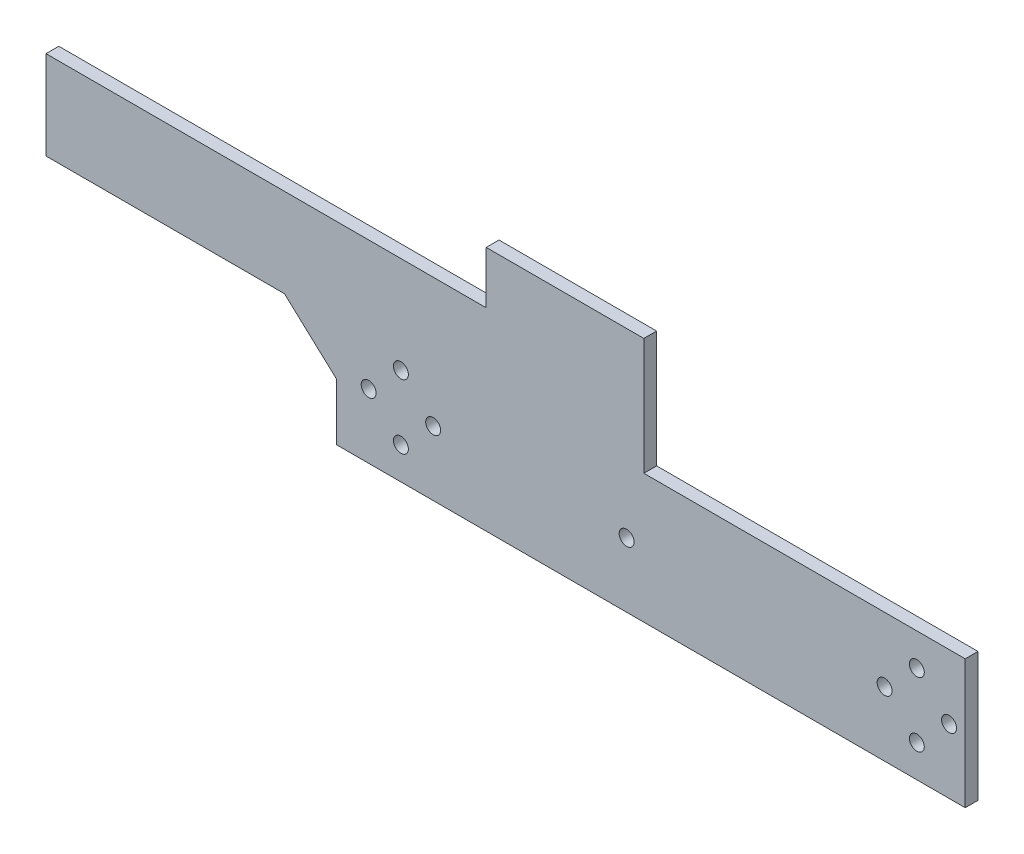
ISO-10303-21;
HEADER;
FILE_DESCRIPTION(('STEP AP214'),'2;1');
FILE_NAME('part.step','',(''),(''),'','','');
FILE_SCHEMA(('AUTOMOTIVE_DESIGN { 1 0 10303 214 1 1 1 1 }'));
ENDSEC;
DATA;
#1=APPLICATION_CONTEXT('core data for automotive mechanical design processes');
#2=APPLICATION_PROTOCOL_DEFINITION('international standard','automotive_design',2000,#1);
#3=PRODUCT_CONTEXT('',#1,'mechanical');
#4=PRODUCT('Part','Part','',(#3));
#5=PRODUCT_RELATED_PRODUCT_CATEGORY('part','',(#4));
#6=PRODUCT_DEFINITION_FORMATION('','',#4);
#7=PRODUCT_DEFINITION_CONTEXT('part definition',#1,'design');
#8=PRODUCT_DEFINITION('design','',#6,#7);
#9=PRODUCT_DEFINITION_SHAPE('','',#8);
#10=(LENGTH_UNIT() NAMED_UNIT(*) SI_UNIT(.MILLI.,.METRE.));
#11=(NAMED_UNIT(*) PLANE_ANGLE_UNIT() SI_UNIT($,.RADIAN.));
#12=(NAMED_UNIT(*) SI_UNIT($,.STERADIAN.) SOLID_ANGLE_UNIT());
#13=UNCERTAINTY_MEASURE_WITH_UNIT(LENGTH_MEASURE(1.E-05),#10,'distance_accuracy_value','');
#14=(GEOMETRIC_REPRESENTATION_CONTEXT(3) GLOBAL_UNCERTAINTY_ASSIGNED_CONTEXT((#13)) GLOBAL_UNIT_ASSIGNED_CONTEXT((#10,
#11,#12)) REPRESENTATION_CONTEXT('',''));
#15=CARTESIAN_POINT('',(0.,0.,0.));
#16=DIRECTION('',(0.,0.,1.));
#17=DIRECTION('',(1.,0.,0.));
#18=AXIS2_PLACEMENT_3D('',#15,#16,#17);
#19=CARTESIAN_POINT('',(0.,0.,3.175));
#20=DIRECTION('',(0.,0.,-1.));
#21=DIRECTION('',(-1.,0.,0.));
#22=AXIS2_PLACEMENT_3D('',#19,#20,#21);
#23=PLANE('',#22);
#24=DIRECTION('',(0.,-1.,0.));
#25=VECTOR('',#24,1.);
#26=CARTESIAN_POINT('',(-72.0466,26.,3.175));
#27=LINE('',#26,#25);
#28=CARTESIAN_POINT('',(-72.0466,48.,3.175));
#29=VERTEX_POINT('',#28);
#30=CARTESIAN_POINT('',(-72.0466,26.,3.175));
#31=VERTEX_POINT('',#30);
#32=EDGE_CURVE('E169',#29,#31,#27,.T.);
#33=ORIENTED_EDGE('',*,*,#32,.T.);
#34=DIRECTION('',(1.,0.,0.));
#35=VECTOR('',#34,1.);
#36=CARTESIAN_POINT('',(-12.8974371585286,26.,3.175));
#37=LINE('',#36,#35);
#38=CARTESIAN_POINT('',(-12.8974371585286,26.,3.175));
#39=VERTEX_POINT('',#38);
#40=EDGE_CURVE('E102',#31,#39,#37,.T.);
#41=ORIENTED_EDGE('',*,*,#40,.T.);
#42=DIRECTION('',(0.736375848281951,-0.676572693852654,0.));
#43=VECTOR('',#42,1.);
#44=CARTESIAN_POINT('',(0.,14.15,3.175));
#45=LINE('',#44,#43);
#46=CARTESIAN_POINT('',(0.,14.15,3.175));
#47=VERTEX_POINT('',#46);
#48=EDGE_CURVE('E193',#39,#47,#45,.T.);
#49=ORIENTED_EDGE('',*,*,#48,.T.);
#50=DIRECTION('',(0.,-1.,0.));
#51=VECTOR('',#50,1.);
#52=CARTESIAN_POINT('',(0.,14.15,3.175));
#53=LINE('',#52,#51);
#54=CARTESIAN_POINT('',(0.,0.,3.175));
#55=VERTEX_POINT('',#54);
#56=EDGE_CURVE('E212',#47,#55,#53,.T.);
#57=ORIENTED_EDGE('',*,*,#56,.T.);
#58=DIRECTION('',(1.,0.,0.));
#59=VECTOR('',#58,1.);
#60=CARTESIAN_POINT('',(156.,0.,3.175));
#61=LINE('',#60,#59);
#62=CARTESIAN_POINT('',(156.,0.,3.175));
#63=VERTEX_POINT('',#62);
#64=EDGE_CURVE('E209',#55,#63,#61,.T.);
#65=ORIENTED_EDGE('',*,*,#64,.T.);
#66=DIRECTION('',(0.,1.,0.));
#67=VECTOR('',#66,1.);
#68=CARTESIAN_POINT('',(156.,32.,3.175));
#69=LINE('',#68,#67);
#70=CARTESIAN_POINT('',(156.,32.,3.175));
#71=VERTEX_POINT('',#70);
#72=EDGE_CURVE('E211',#63,#71,#69,.T.);
#73=ORIENTED_EDGE('',*,*,#72,.T.);
#74=DIRECTION('',(-1.,0.,0.));
#75=VECTOR('',#74,1.);
#76=CARTESIAN_POINT('',(76.2722,32.,3.175));
#77=LINE('',#76,#75);
#78=CARTESIAN_POINT('',(76.2722,32.,3.175));
#79=VERTEX_POINT('',#78);
#80=EDGE_CURVE('E214',#71,#79,#77,.T.);
#81=ORIENTED_EDGE('',*,*,#80,.T.);
#82=DIRECTION('',(0.,1.,0.));
#83=VECTOR('',#82,1.);
#84=CARTESIAN_POINT('',(76.2722,60.974999999998,3.175));
#85=LINE('',#84,#83);
#86=CARTESIAN_POINT('',(76.2722,60.974999999998,3.175));
#87=VERTEX_POINT('',#86);
#88=EDGE_CURVE('E130',#79,#87,#85,.T.);
#89=ORIENTED_EDGE('',*,*,#88,.T.);
#90=DIRECTION('',(-1.,0.,0.));
#91=VECTOR('',#90,1.);
#92=CARTESIAN_POINT('',(76.2722,60.974999999998,3.175));
#93=LINE('',#92,#91);
#94=CARTESIAN_POINT('',(37.159,60.974999999998,3.175));
#95=VERTEX_POINT('',#94);
#96=EDGE_CURVE('E124',#87,#95,#93,.T.);
#97=ORIENTED_EDGE('',*,*,#96,.T.);
#98=DIRECTION('',(0.,-1.,0.));
#99=VECTOR('',#98,1.);
#100=CARTESIAN_POINT('',(37.159,60.974999999998,3.175));
#101=LINE('',#100,#99);
#102=CARTESIAN_POINT('',(37.159,48.,3.175));
#103=VERTEX_POINT('',#102);
#104=EDGE_CURVE('E128',#95,#103,#101,.T.);
#105=ORIENTED_EDGE('',*,*,#104,.T.);
#106=DIRECTION('',(-1.,0.,0.));
#107=VECTOR('',#106,1.);
#108=CARTESIAN_POINT('',(-72.0466,48.,3.175));
#109=LINE('',#108,#107);
#110=EDGE_CURVE('E50',#103,#29,#109,.T.);
#111=ORIENTED_EDGE('',*,*,#110,.T.);
#112=EDGE_LOOP('',(#33,#41,#49,#57,#65,#73,#81,#89,#97,#105,#111));
#113=FACE_BOUND('',#112,.T.);
#114=CARTESIAN_POINT('',(144.,8.,3.175));
#115=DIRECTION('',(0.,0.,1.));
#116=DIRECTION('',(1.,0.,0.));
#117=AXIS2_PLACEMENT_3D('',#114,#115,#116);
#118=CIRCLE('',#117,1.85);
#119=CARTESIAN_POINT('',(145.85,8.,3.175));
#120=VERTEX_POINT('',#119);
#121=EDGE_CURVE('E152',#120,#120,#118,.T.);
#122=ORIENTED_EDGE('',*,*,#121,.F.);
#123=EDGE_LOOP('',(#122));
#124=FACE_BOUND('',#123,.T.);
#125=CARTESIAN_POINT('',(144.,24.,3.175));
#126=DIRECTION('',(0.,0.,1.));
#127=DIRECTION('',(1.,0.,0.));
#128=AXIS2_PLACEMENT_3D('',#125,#126,#127);
#129=CIRCLE('',#128,1.85);
#130=CARTESIAN_POINT('',(145.85,24.,3.175));
#131=VERTEX_POINT('',#130);
#132=EDGE_CURVE('E331',#131,#131,#129,.T.);
#133=ORIENTED_EDGE('',*,*,#132,.F.);
#134=EDGE_LOOP('',(#133));
#135=FACE_BOUND('',#134,.T.);
#136=CARTESIAN_POINT('',(152.,16.,3.175));
#137=DIRECTION('',(0.,0.,1.));
#138=DIRECTION('',(1.,0.,0.));
#139=AXIS2_PLACEMENT_3D('',#136,#137,#138);
#140=CIRCLE('',#139,1.85);
#141=CARTESIAN_POINT('',(153.85,16.,3.175));
#142=VERTEX_POINT('',#141);
#143=EDGE_CURVE('E325',#142,#142,#140,.T.);
#144=ORIENTED_EDGE('',*,*,#143,.F.);
#145=EDGE_LOOP('',(#144));
#146=FACE_BOUND('',#145,.T.);
#147=CARTESIAN_POINT('',(136.,16.,3.175));
#148=DIRECTION('',(0.,0.,1.));
#149=DIRECTION('',(1.,0.,0.));
#150=AXIS2_PLACEMENT_3D('',#147,#148,#149);
#151=CIRCLE('',#150,1.85);
#152=CARTESIAN_POINT('',(137.85,16.,3.175));
#153=VERTEX_POINT('',#152);
#154=EDGE_CURVE('E319',#153,#153,#151,.T.);
#155=ORIENTED_EDGE('',*,*,#154,.F.);
#156=EDGE_LOOP('',(#155));
#157=FACE_BOUND('',#156,.T.);
#158=CARTESIAN_POINT('',(24.,16.,3.175));
#159=DIRECTION('',(0.,0.,1.));
#160=DIRECTION('',(1.,0.,0.));
#161=AXIS2_PLACEMENT_3D('',#158,#159,#160);
#162=CIRCLE('',#161,1.84999999999999);
#163=CARTESIAN_POINT('',(25.85,16.,3.175));
#164=VERTEX_POINT('',#163);
#165=EDGE_CURVE('E313',#164,#164,#162,.T.);
#166=ORIENTED_EDGE('',*,*,#165,.F.);
#167=EDGE_LOOP('',(#166));
#168=FACE_BOUND('',#167,.T.);
#169=CARTESIAN_POINT('',(16.,8.,3.175));
#170=DIRECTION('',(0.,0.,1.));
#171=DIRECTION('',(1.,0.,0.));
#172=AXIS2_PLACEMENT_3D('',#169,#170,#171);
#173=CIRCLE('',#172,1.84999999999999);
#174=CARTESIAN_POINT('',(17.85,8.,3.175));
#175=VERTEX_POINT('',#174);
#176=EDGE_CURVE('E307',#175,#175,#173,.T.);
#177=ORIENTED_EDGE('',*,*,#176,.F.);
#178=EDGE_LOOP('',(#177));
#179=FACE_BOUND('',#178,.T.);
#180=CARTESIAN_POINT('',(8.00000000000004,16.,3.175));
#181=DIRECTION('',(0.,0.,1.));
#182=DIRECTION('',(1.,0.,0.));
#183=AXIS2_PLACEMENT_3D('',#180,#181,#182);
#184=CIRCLE('',#183,1.84999999999999);
#185=CARTESIAN_POINT('',(9.85000000000003,16.,3.175));
#186=VERTEX_POINT('',#185);
#187=EDGE_CURVE('E301',#186,#186,#184,.T.);
#188=ORIENTED_EDGE('',*,*,#187,.F.);
#189=EDGE_LOOP('',(#188));
#190=FACE_BOUND('',#189,.T.);
#191=CARTESIAN_POINT('',(16.,24.,3.175));
#192=DIRECTION('',(0.,0.,1.));
#193=DIRECTION('',(1.,0.,0.));
#194=AXIS2_PLACEMENT_3D('',#191,#192,#193);
#195=CIRCLE('',#194,1.84999999999999);
#196=CARTESIAN_POINT('',(17.85,24.,3.175));
#197=VERTEX_POINT('',#196);
#198=EDGE_CURVE('E295',#197,#197,#195,.T.);
#199=ORIENTED_EDGE('',*,*,#198,.F.);
#200=EDGE_LOOP('',(#199));
#201=FACE_BOUND('',#200,.T.);
#202=CARTESIAN_POINT('',(72.0000000000001,16.,3.175));
#203=DIRECTION('',(0.,0.,1.));
#204=DIRECTION('',(1.,0.,0.));
#205=AXIS2_PLACEMENT_3D('',#202,#203,#204);
#206=CIRCLE('',#205,1.84999999999998);
#207=CARTESIAN_POINT('',(73.85,16.,3.175));
#208=VERTEX_POINT('',#207);
#209=EDGE_CURVE('E286',#208,#208,#206,.T.);
#210=ORIENTED_EDGE('',*,*,#209,.F.);
#211=EDGE_LOOP('',(#210));
#212=FACE_BOUND('',#211,.T.);
#213=ADVANCED_FACE('F33',(#113,#124,#135,#146,#157,#168,#179,#190,#201,#212),#23,.F.);
#214=CARTESIAN_POINT('',(0.,0.,0.));
#215=DIRECTION('',(0.,0.,-1.));
#216=DIRECTION('',(-1.,0.,0.));
#217=AXIS2_PLACEMENT_3D('',#214,#215,#216);
#218=PLANE('',#217);
#219=CARTESIAN_POINT('',(16.,24.,0.));
#220=DIRECTION('',(0.,0.,1.));
#221=DIRECTION('',(1.,0.,0.));
#222=AXIS2_PLACEMENT_3D('',#219,#220,#221);
#223=CIRCLE('',#222,1.84999999999999);
#224=CARTESIAN_POINT('',(17.85,24.,0.));
#225=VERTEX_POINT('',#224);
#226=EDGE_CURVE('E292',#225,#225,#223,.T.);
#227=ORIENTED_EDGE('',*,*,#226,.T.);
#228=EDGE_LOOP('',(#227));
#229=FACE_BOUND('',#228,.T.);
#230=CARTESIAN_POINT('',(16.,8.,0.));
#231=DIRECTION('',(0.,0.,1.));
#232=DIRECTION('',(1.,0.,0.));
#233=AXIS2_PLACEMENT_3D('',#230,#231,#232);
#234=CIRCLE('',#233,1.84999999999999);
#235=CARTESIAN_POINT('',(17.85,8.,0.));
#236=VERTEX_POINT('',#235);
#237=EDGE_CURVE('E304',#236,#236,#234,.T.);
#238=ORIENTED_EDGE('',*,*,#237,.T.);
#239=EDGE_LOOP('',(#238));
#240=FACE_BOUND('',#239,.T.);
#241=CARTESIAN_POINT('',(136.,16.,0.));
#242=DIRECTION('',(0.,0.,1.));
#243=DIRECTION('',(1.,0.,0.));
#244=AXIS2_PLACEMENT_3D('',#241,#242,#243);
#245=CIRCLE('',#244,1.85);
#246=CARTESIAN_POINT('',(137.85,16.,0.));
#247=VERTEX_POINT('',#246);
#248=EDGE_CURVE('E316',#247,#247,#245,.T.);
#249=ORIENTED_EDGE('',*,*,#248,.T.);
#250=EDGE_LOOP('',(#249));
#251=FACE_BOUND('',#250,.T.);
#252=CARTESIAN_POINT('',(144.,24.,0.));
#253=DIRECTION('',(0.,0.,1.));
#254=DIRECTION('',(1.,0.,0.));
#255=AXIS2_PLACEMENT_3D('',#252,#253,#254);
#256=CIRCLE('',#255,1.85);
#257=CARTESIAN_POINT('',(145.85,24.,0.));
#258=VERTEX_POINT('',#257);
#259=EDGE_CURVE('E328',#258,#258,#256,.T.);
#260=ORIENTED_EDGE('',*,*,#259,.T.);
#261=EDGE_LOOP('',(#260));
#262=FACE_BOUND('',#261,.T.);
#263=DIRECTION('',(0.,-1.,0.));
#264=VECTOR('',#263,1.);
#265=CARTESIAN_POINT('',(-72.0466,26.,0.));
#266=LINE('',#265,#264);
#267=CARTESIAN_POINT('',(-72.0466,48.,0.));
#268=VERTEX_POINT('',#267);
#269=CARTESIAN_POINT('',(-72.0466,26.,0.));
#270=VERTEX_POINT('',#269);
#271=EDGE_CURVE('E148',#268,#270,#266,.T.);
#272=ORIENTED_EDGE('',*,*,#271,.F.);
#273=DIRECTION('',(-1.,0.,0.));
#274=VECTOR('',#273,1.);
#275=CARTESIAN_POINT('',(-72.0466,48.,0.));
#276=LINE('',#275,#274);
#277=CARTESIAN_POINT('',(37.159,48.,0.));
#278=VERTEX_POINT('',#277);
#279=EDGE_CURVE('E94',#278,#268,#276,.T.);
#280=ORIENTED_EDGE('',*,*,#279,.F.);
#281=DIRECTION('',(0.,-1.,0.));
#282=VECTOR('',#281,1.);
#283=CARTESIAN_POINT('',(37.159,60.974999999998,0.));
#284=LINE('',#283,#282);
#285=CARTESIAN_POINT('',(37.159,60.974999999998,0.));
#286=VERTEX_POINT('',#285);
#287=EDGE_CURVE('E88',#286,#278,#284,.T.);
#288=ORIENTED_EDGE('',*,*,#287,.F.);
#289=DIRECTION('',(-1.,0.,0.));
#290=VECTOR('',#289,1.);
#291=CARTESIAN_POINT('',(76.2722,60.974999999998,0.));
#292=LINE('',#291,#290);
#293=CARTESIAN_POINT('',(76.2722,60.974999999998,0.));
#294=VERTEX_POINT('',#293);
#295=EDGE_CURVE('E138',#294,#286,#292,.T.);
#296=ORIENTED_EDGE('',*,*,#295,.F.);
#297=DIRECTION('',(0.,1.,0.));
#298=VECTOR('',#297,1.);
#299=CARTESIAN_POINT('',(76.2722,60.974999999998,0.));
#300=LINE('',#299,#298);
#301=CARTESIAN_POINT('',(76.2722,32.,0.));
#302=VERTEX_POINT('',#301);
#303=EDGE_CURVE('E164',#302,#294,#300,.T.);
#304=ORIENTED_EDGE('',*,*,#303,.F.);
#305=DIRECTION('',(-1.,0.,0.));
#306=VECTOR('',#305,1.);
#307=CARTESIAN_POINT('',(76.2722,32.,0.));
#308=LINE('',#307,#306);
#309=CARTESIAN_POINT('',(156.,32.,0.));
#310=VERTEX_POINT('',#309);
#311=EDGE_CURVE('E162',#310,#302,#308,.T.);
#312=ORIENTED_EDGE('',*,*,#311,.F.);
#313=DIRECTION('',(0.,1.,0.));
#314=VECTOR('',#313,1.);
#315=CARTESIAN_POINT('',(156.,32.,0.));
#316=LINE('',#315,#314);
#317=CARTESIAN_POINT('',(156.,0.,0.));
#318=VERTEX_POINT('',#317);
#319=EDGE_CURVE('E160',#318,#310,#316,.T.);
#320=ORIENTED_EDGE('',*,*,#319,.F.);
#321=DIRECTION('',(1.,0.,0.));
#322=VECTOR('',#321,1.);
#323=CARTESIAN_POINT('',(156.,0.,0.));
#324=LINE('',#323,#322);
#325=CARTESIAN_POINT('',(0.,0.,0.));
#326=VERTEX_POINT('',#325);
#327=EDGE_CURVE('E158',#326,#318,#324,.T.);
#328=ORIENTED_EDGE('',*,*,#327,.F.);
#329=DIRECTION('',(0.,-1.,0.));
#330=VECTOR('',#329,1.);
#331=CARTESIAN_POINT('',(0.,14.15,0.));
#332=LINE('',#331,#330);
#333=CARTESIAN_POINT('',(0.,14.15,0.));
#334=VERTEX_POINT('',#333);
#335=EDGE_CURVE('E156',#334,#326,#332,.T.);
#336=ORIENTED_EDGE('',*,*,#335,.F.);
#337=DIRECTION('',(0.736375848281951,-0.676572693852654,0.));
#338=VECTOR('',#337,1.);
#339=CARTESIAN_POINT('',(0.,14.15,0.));
#340=LINE('',#339,#338);
#341=CARTESIAN_POINT('',(-12.8974371585286,26.,0.));
#342=VERTEX_POINT('',#341);
#343=EDGE_CURVE('E154',#342,#334,#340,.T.);
#344=ORIENTED_EDGE('',*,*,#343,.F.);
#345=DIRECTION('',(1.,0.,0.));
#346=VECTOR('',#345,1.);
#347=CARTESIAN_POINT('',(-12.8974371585286,26.,0.));
#348=LINE('',#347,#346);
#349=EDGE_CURVE('E151',#270,#342,#348,.T.);
#350=ORIENTED_EDGE('',*,*,#349,.F.);
#351=EDGE_LOOP('',(#272,#280,#288,#296,#304,#312,#320,#328,#336,#344,#350));
#352=FACE_BOUND('',#351,.T.);
#353=CARTESIAN_POINT('',(144.,8.,0.));
#354=DIRECTION('',(0.,0.,1.));
#355=DIRECTION('',(1.,0.,0.));
#356=AXIS2_PLACEMENT_3D('',#353,#354,#355);
#357=CIRCLE('',#356,1.85);
#358=CARTESIAN_POINT('',(145.85,8.,0.));
#359=VERTEX_POINT('',#358);
#360=EDGE_CURVE('E334',#359,#359,#357,.T.);
#361=ORIENTED_EDGE('',*,*,#360,.T.);
#362=EDGE_LOOP('',(#361));
#363=FACE_BOUND('',#362,.T.);
#364=CARTESIAN_POINT('',(152.,16.,0.));
#365=DIRECTION('',(0.,0.,1.));
#366=DIRECTION('',(1.,0.,0.));
#367=AXIS2_PLACEMENT_3D('',#364,#365,#366);
#368=CIRCLE('',#367,1.85);
#369=CARTESIAN_POINT('',(153.85,16.,0.));
#370=VERTEX_POINT('',#369);
#371=EDGE_CURVE('E322',#370,#370,#368,.T.);
#372=ORIENTED_EDGE('',*,*,#371,.T.);
#373=EDGE_LOOP('',(#372));
#374=FACE_BOUND('',#373,.T.);
#375=CARTESIAN_POINT('',(24.,16.,0.));
#376=DIRECTION('',(0.,0.,1.));
#377=DIRECTION('',(1.,0.,0.));
#378=AXIS2_PLACEMENT_3D('',#375,#376,#377);
#379=CIRCLE('',#378,1.84999999999999);
#380=CARTESIAN_POINT('',(25.85,16.,0.));
#381=VERTEX_POINT('',#380);
#382=EDGE_CURVE('E310',#381,#381,#379,.T.);
#383=ORIENTED_EDGE('',*,*,#382,.T.);
#384=EDGE_LOOP('',(#383));
#385=FACE_BOUND('',#384,.T.);
#386=CARTESIAN_POINT('',(8.00000000000004,16.,0.));
#387=DIRECTION('',(0.,0.,1.));
#388=DIRECTION('',(1.,0.,0.));
#389=AXIS2_PLACEMENT_3D('',#386,#387,#388);
#390=CIRCLE('',#389,1.84999999999999);
#391=CARTESIAN_POINT('',(9.85000000000003,16.,0.));
#392=VERTEX_POINT('',#391);
#393=EDGE_CURVE('E298',#392,#392,#390,.T.);
#394=ORIENTED_EDGE('',*,*,#393,.T.);
#395=EDGE_LOOP('',(#394));
#396=FACE_BOUND('',#395,.T.);
#397=CARTESIAN_POINT('',(72.0000000000001,16.,0.));
#398=DIRECTION('',(0.,0.,1.));
#399=DIRECTION('',(1.,0.,0.));
#400=AXIS2_PLACEMENT_3D('',#397,#398,#399);
#401=CIRCLE('',#400,1.84999999999998);
#402=CARTESIAN_POINT('',(73.85,16.,0.));
#403=VERTEX_POINT('',#402);
#404=EDGE_CURVE('E289',#403,#403,#401,.T.);
#405=ORIENTED_EDGE('',*,*,#404,.T.);
#406=EDGE_LOOP('',(#405));
#407=FACE_BOUND('',#406,.T.);
#408=ADVANCED_FACE('F197',(#229,#240,#251,#262,#352,#363,#374,#385,#396,#407),#218,.T.);
#409=CARTESIAN_POINT('',(-72.0466,26.,3.175));
#410=DIRECTION('',(1.,0.,0.));
#411=DIRECTION('',(0.,0.,-1.));
#412=AXIS2_PLACEMENT_3D('',#409,#410,#411);
#413=PLANE('',#412);
#414=ORIENTED_EDGE('',*,*,#271,.T.);
#415=DIRECTION('',(0.,0.,-1.));
#416=VECTOR('',#415,1.);
#417=CARTESIAN_POINT('',(-72.0466,26.,3.175));
#418=LINE('',#417,#416);
#419=EDGE_CURVE('E11',#31,#270,#418,.T.);
#420=ORIENTED_EDGE('',*,*,#419,.F.);
#421=ORIENTED_EDGE('',*,*,#32,.F.);
#422=DIRECTION('',(0.,0.,-1.));
#423=VECTOR('',#422,1.);
#424=CARTESIAN_POINT('',(-72.0466,48.,3.175));
#425=LINE('',#424,#423);
#426=EDGE_CURVE('E144',#29,#268,#425,.T.);
#427=ORIENTED_EDGE('',*,*,#426,.T.);
#428=EDGE_LOOP('',(#414,#420,#421,#427));
#429=FACE_BOUND('',#428,.T.);
#430=ADVANCED_FACE('F35',(#429),#413,.F.);
#431=CARTESIAN_POINT('',(-12.8974371585286,26.,3.175));
#432=DIRECTION('',(0.,1.,0.));
#433=DIRECTION('',(-1.,0.,0.));
#434=AXIS2_PLACEMENT_3D('',#431,#432,#433);
#435=PLANE('',#434);
#436=ORIENTED_EDGE('',*,*,#349,.T.);
#437=DIRECTION('',(0.,0.,-1.));
#438=VECTOR('',#437,1.);
#439=CARTESIAN_POINT('',(-12.8974371585286,26.,3.175));
#440=LINE('',#439,#438);
#441=EDGE_CURVE('E42',#39,#342,#440,.T.);
#442=ORIENTED_EDGE('',*,*,#441,.F.);
#443=ORIENTED_EDGE('',*,*,#40,.F.);
#444=ORIENTED_EDGE('',*,*,#419,.T.);
#445=EDGE_LOOP('',(#436,#442,#443,#444));
#446=FACE_BOUND('',#445,.T.);
#447=ADVANCED_FACE('F481',(#446),#435,.F.);
#448=CARTESIAN_POINT('',(0.,14.15,3.175));
#449=DIRECTION('',(0.676572693852654,0.736375848281951,0.));
#450=DIRECTION('',(-0.736375848281951,0.676572693852654,0.));
#451=AXIS2_PLACEMENT_3D('',#448,#449,#450);
#452=PLANE('',#451);
#453=ORIENTED_EDGE('',*,*,#343,.T.);
#454=DIRECTION('',(0.,0.,-1.));
#455=VECTOR('',#454,1.);
#456=CARTESIAN_POINT('',(0.,14.15,3.175));
#457=LINE('',#456,#455);
#458=EDGE_CURVE('E185',#47,#334,#457,.T.);
#459=ORIENTED_EDGE('',*,*,#458,.F.);
#460=ORIENTED_EDGE('',*,*,#48,.F.);
#461=ORIENTED_EDGE('',*,*,#441,.T.);
#462=EDGE_LOOP('',(#453,#459,#460,#461));
#463=FACE_BOUND('',#462,.T.);
#464=ADVANCED_FACE('F191',(#463),#452,.F.);
#465=CARTESIAN_POINT('',(0.,14.15,3.175));
#466=DIRECTION('',(1.,0.,0.));
#467=DIRECTION('',(0.,0.,-1.));
#468=AXIS2_PLACEMENT_3D('',#465,#466,#467);
#469=PLANE('',#468);
#470=ORIENTED_EDGE('',*,*,#335,.T.);
#471=DIRECTION('',(0.,0.,-1.));
#472=VECTOR('',#471,1.);
#473=CARTESIAN_POINT('',(0.,0.,3.175));
#474=LINE('',#473,#472);
#475=EDGE_CURVE('E182',#55,#326,#474,.T.);
#476=ORIENTED_EDGE('',*,*,#475,.F.);
#477=ORIENTED_EDGE('',*,*,#56,.F.);
#478=ORIENTED_EDGE('',*,*,#458,.T.);
#479=EDGE_LOOP('',(#470,#476,#477,#478));
#480=FACE_BOUND('',#479,.T.);
#481=ADVANCED_FACE('F203',(#480),#469,.F.);
#482=CARTESIAN_POINT('',(156.,0.,3.175));
#483=DIRECTION('',(0.,1.,0.));
#484=DIRECTION('',(0.,0.,1.));
#485=AXIS2_PLACEMENT_3D('',#482,#483,#484);
#486=PLANE('',#485);
#487=ORIENTED_EDGE('',*,*,#327,.T.);
#488=DIRECTION('',(0.,0.,-1.));
#489=VECTOR('',#488,1.);
#490=CARTESIAN_POINT('',(156.,0.,3.175));
#491=LINE('',#490,#489);
#492=EDGE_CURVE('E179',#63,#318,#491,.T.);
#493=ORIENTED_EDGE('',*,*,#492,.F.);
#494=ORIENTED_EDGE('',*,*,#64,.F.);
#495=ORIENTED_EDGE('',*,*,#475,.T.);
#496=EDGE_LOOP('',(#487,#493,#494,#495));
#497=FACE_BOUND('',#496,.T.);
#498=ADVANCED_FACE('F207',(#497),#486,.F.);
#499=CARTESIAN_POINT('',(156.,32.,3.175));
#500=DIRECTION('',(-1.,0.,0.));
#501=DIRECTION('',(0.,0.,1.));
#502=AXIS2_PLACEMENT_3D('',#499,#500,#501);
#503=PLANE('',#502);
#504=ORIENTED_EDGE('',*,*,#319,.T.);
#505=DIRECTION('',(0.,0.,-1.));
#506=VECTOR('',#505,1.);
#507=CARTESIAN_POINT('',(156.,32.,3.175));
#508=LINE('',#507,#506);
#509=EDGE_CURVE('E176',#71,#310,#508,.T.);
#510=ORIENTED_EDGE('',*,*,#509,.F.);
#511=ORIENTED_EDGE('',*,*,#72,.F.);
#512=ORIENTED_EDGE('',*,*,#492,.T.);
#513=EDGE_LOOP('',(#504,#510,#511,#512));
#514=FACE_BOUND('',#513,.T.);
#515=ADVANCED_FACE('F447',(#514),#503,.F.);
#516=CARTESIAN_POINT('',(76.2722,32.,3.175));
#517=DIRECTION('',(0.,-1.,0.));
#518=DIRECTION('',(1.,0.,0.));
#519=AXIS2_PLACEMENT_3D('',#516,#517,#518);
#520=PLANE('',#519);
#521=ORIENTED_EDGE('',*,*,#311,.T.);
#522=DIRECTION('',(0.,0.,-1.));
#523=VECTOR('',#522,1.);
#524=CARTESIAN_POINT('',(76.2722,32.,3.175));
#525=LINE('',#524,#523);
#526=EDGE_CURVE('E173',#79,#302,#525,.T.);
#527=ORIENTED_EDGE('',*,*,#526,.F.);
#528=ORIENTED_EDGE('',*,*,#80,.F.);
#529=ORIENTED_EDGE('',*,*,#509,.T.);
#530=EDGE_LOOP('',(#521,#527,#528,#529));
#531=FACE_BOUND('',#530,.T.);
#532=ADVANCED_FACE('F223',(#531),#520,.F.);
#533=CARTESIAN_POINT('',(76.2722,60.974999999998,3.175));
#534=DIRECTION('',(-1.,0.,0.));
#535=DIRECTION('',(0.,-1.,0.));
#536=AXIS2_PLACEMENT_3D('',#533,#534,#535);
#537=PLANE('',#536);
#538=ORIENTED_EDGE('',*,*,#303,.T.);
#539=DIRECTION('',(0.,0.,-1.));
#540=VECTOR('',#539,1.);
#541=CARTESIAN_POINT('',(76.2722,60.974999999998,3.175));
#542=LINE('',#541,#540);
#543=EDGE_CURVE('E139',#87,#294,#542,.T.);
#544=ORIENTED_EDGE('',*,*,#543,.F.);
#545=ORIENTED_EDGE('',*,*,#88,.F.);
#546=ORIENTED_EDGE('',*,*,#526,.T.);
#547=EDGE_LOOP('',(#538,#544,#545,#546));
#548=FACE_BOUND('',#547,.T.);
#549=ADVANCED_FACE('F227',(#548),#537,.F.);
#550=CARTESIAN_POINT('',(76.2722,60.974999999998,3.175));
#551=DIRECTION('',(0.,-1.,0.));
#552=DIRECTION('',(0.,0.,-1.));
#553=AXIS2_PLACEMENT_3D('',#550,#551,#552);
#554=PLANE('',#553);
#555=ORIENTED_EDGE('',*,*,#295,.T.);
#556=DIRECTION('',(0.,0.,-1.));
#557=VECTOR('',#556,1.);
#558=CARTESIAN_POINT('',(37.159,60.974999999998,3.175));
#559=LINE('',#558,#557);
#560=EDGE_CURVE('E135',#95,#286,#559,.T.);
#561=ORIENTED_EDGE('',*,*,#560,.F.);
#562=ORIENTED_EDGE('',*,*,#96,.F.);
#563=ORIENTED_EDGE('',*,*,#543,.T.);
#564=EDGE_LOOP('',(#555,#561,#562,#563));
#565=FACE_BOUND('',#564,.T.);
#566=ADVANCED_FACE('F136',(#565),#554,.F.);
#567=CARTESIAN_POINT('',(37.159,60.974999999998,3.175));
#568=DIRECTION('',(1.,0.,0.));
#569=DIRECTION('',(0.,0.,-1.));
#570=AXIS2_PLACEMENT_3D('',#567,#568,#569);
#571=PLANE('',#570);
#572=ORIENTED_EDGE('',*,*,#287,.T.);
#573=DIRECTION('',(0.,0.,-1.));
#574=VECTOR('',#573,1.);
#575=CARTESIAN_POINT('',(37.159,48.,3.175));
#576=LINE('',#575,#574);
#577=EDGE_CURVE('E140',#103,#278,#576,.T.);
#578=ORIENTED_EDGE('',*,*,#577,.F.);
#579=ORIENTED_EDGE('',*,*,#104,.F.);
#580=ORIENTED_EDGE('',*,*,#560,.T.);
#581=EDGE_LOOP('',(#572,#578,#579,#580));
#582=FACE_BOUND('',#581,.T.);
#583=ADVANCED_FACE('F142',(#582),#571,.F.);
#584=CARTESIAN_POINT('',(-72.0466,48.,3.175));
#585=DIRECTION('',(0.,-1.,0.));
#586=DIRECTION('',(1.,0.,0.));
#587=AXIS2_PLACEMENT_3D('',#584,#585,#586);
#588=PLANE('',#587);
#589=ORIENTED_EDGE('',*,*,#279,.T.);
#590=ORIENTED_EDGE('',*,*,#426,.F.);
#591=ORIENTED_EDGE('',*,*,#110,.F.);
#592=ORIENTED_EDGE('',*,*,#577,.T.);
#593=EDGE_LOOP('',(#589,#590,#591,#592));
#594=FACE_BOUND('',#593,.T.);
#595=ADVANCED_FACE('F231',(#594),#588,.F.);
#596=CARTESIAN_POINT('',(144.,8.,3.175));
#597=DIRECTION('',(0.,0.,-1.));
#598=DIRECTION('',(-1.,0.,0.));
#599=AXIS2_PLACEMENT_3D('',#596,#597,#598);
#600=CYLINDRICAL_SURFACE('',#599,1.85);
#601=ORIENTED_EDGE('',*,*,#121,.T.);
#602=EDGE_LOOP('',(#601));
#603=FACE_BOUND('',#602,.T.);
#604=ORIENTED_EDGE('',*,*,#360,.F.);
#605=EDGE_LOOP('',(#604));
#606=FACE_BOUND('',#605,.T.);
#607=ADVANCED_FACE('F233',(#603,#606),#600,.F.);
#608=CARTESIAN_POINT('',(144.,24.,3.175));
#609=DIRECTION('',(0.,0.,-1.));
#610=DIRECTION('',(-1.,0.,0.));
#611=AXIS2_PLACEMENT_3D('',#608,#609,#610);
#612=CYLINDRICAL_SURFACE('',#611,1.85);
#613=ORIENTED_EDGE('',*,*,#132,.T.);
#614=EDGE_LOOP('',(#613));
#615=FACE_BOUND('',#614,.T.);
#616=ORIENTED_EDGE('',*,*,#259,.F.);
#617=EDGE_LOOP('',(#616));
#618=FACE_BOUND('',#617,.T.);
#619=ADVANCED_FACE('F239',(#615,#618),#612,.F.);
#620=CARTESIAN_POINT('',(152.,16.,3.175));
#621=DIRECTION('',(0.,0.,-1.));
#622=DIRECTION('',(-1.,0.,0.));
#623=AXIS2_PLACEMENT_3D('',#620,#621,#622);
#624=CYLINDRICAL_SURFACE('',#623,1.85);
#625=ORIENTED_EDGE('',*,*,#143,.T.);
#626=EDGE_LOOP('',(#625));
#627=FACE_BOUND('',#626,.T.);
#628=ORIENTED_EDGE('',*,*,#371,.F.);
#629=EDGE_LOOP('',(#628));
#630=FACE_BOUND('',#629,.T.);
#631=ADVANCED_FACE('F253',(#627,#630),#624,.F.);
#632=CARTESIAN_POINT('',(136.,16.,3.175));
#633=DIRECTION('',(0.,0.,-1.));
#634=DIRECTION('',(-1.,0.,0.));
#635=AXIS2_PLACEMENT_3D('',#632,#633,#634);
#636=CYLINDRICAL_SURFACE('',#635,1.85);
#637=ORIENTED_EDGE('',*,*,#154,.T.);
#638=EDGE_LOOP('',(#637));
#639=FACE_BOUND('',#638,.T.);
#640=ORIENTED_EDGE('',*,*,#248,.F.);
#641=EDGE_LOOP('',(#640));
#642=FACE_BOUND('',#641,.T.);
#643=ADVANCED_FACE('F257',(#639,#642),#636,.F.);
#644=CARTESIAN_POINT('',(24.,16.,3.175));
#645=DIRECTION('',(0.,0.,-1.));
#646=DIRECTION('',(-1.,0.,0.));
#647=AXIS2_PLACEMENT_3D('',#644,#645,#646);
#648=CYLINDRICAL_SURFACE('',#647,1.84999999999999);
#649=ORIENTED_EDGE('',*,*,#165,.T.);
#650=EDGE_LOOP('',(#649));
#651=FACE_BOUND('',#650,.T.);
#652=ORIENTED_EDGE('',*,*,#382,.F.);
#653=EDGE_LOOP('',(#652));
#654=FACE_BOUND('',#653,.T.);
#655=ADVANCED_FACE('F261',(#651,#654),#648,.F.);
#656=CARTESIAN_POINT('',(16.,8.,3.175));
#657=DIRECTION('',(0.,0.,-1.));
#658=DIRECTION('',(-1.,0.,0.));
#659=AXIS2_PLACEMENT_3D('',#656,#657,#658);
#660=CYLINDRICAL_SURFACE('',#659,1.84999999999999);
#661=ORIENTED_EDGE('',*,*,#176,.T.);
#662=EDGE_LOOP('',(#661));
#663=FACE_BOUND('',#662,.T.);
#664=ORIENTED_EDGE('',*,*,#237,.F.);
#665=EDGE_LOOP('',(#664));
#666=FACE_BOUND('',#665,.T.);
#667=ADVANCED_FACE('F265',(#663,#666),#660,.F.);
#668=CARTESIAN_POINT('',(8.00000000000004,16.,3.175));
#669=DIRECTION('',(0.,0.,-1.));
#670=DIRECTION('',(-1.,0.,0.));
#671=AXIS2_PLACEMENT_3D('',#668,#669,#670);
#672=CYLINDRICAL_SURFACE('',#671,1.84999999999999);
#673=ORIENTED_EDGE('',*,*,#187,.T.);
#674=EDGE_LOOP('',(#673));
#675=FACE_BOUND('',#674,.T.);
#676=ORIENTED_EDGE('',*,*,#393,.F.);
#677=EDGE_LOOP('',(#676));
#678=FACE_BOUND('',#677,.T.);
#679=ADVANCED_FACE('F269',(#675,#678),#672,.F.);
#680=CARTESIAN_POINT('',(16.,24.,3.175));
#681=DIRECTION('',(0.,0.,-1.));
#682=DIRECTION('',(-1.,0.,0.));
#683=AXIS2_PLACEMENT_3D('',#680,#681,#682);
#684=CYLINDRICAL_SURFACE('',#683,1.84999999999999);
#685=ORIENTED_EDGE('',*,*,#198,.T.);
#686=EDGE_LOOP('',(#685));
#687=FACE_BOUND('',#686,.T.);
#688=ORIENTED_EDGE('',*,*,#226,.F.);
#689=EDGE_LOOP('',(#688));
#690=FACE_BOUND('',#689,.T.);
#691=ADVANCED_FACE('F273',(#687,#690),#684,.F.);
#692=CARTESIAN_POINT('',(72.0000000000001,16.,3.175));
#693=DIRECTION('',(0.,0.,-1.));
#694=DIRECTION('',(-1.,0.,0.));
#695=AXIS2_PLACEMENT_3D('',#692,#693,#694);
#696=CYLINDRICAL_SURFACE('',#695,1.84999999999998);
#697=ORIENTED_EDGE('',*,*,#209,.T.);
#698=EDGE_LOOP('',(#697));
#699=FACE_BOUND('',#698,.T.);
#700=ORIENTED_EDGE('',*,*,#404,.F.);
#701=EDGE_LOOP('',(#700));
#702=FACE_BOUND('',#701,.T.);
#703=ADVANCED_FACE('F277',(#699,#702),#696,.F.);
#704=CLOSED_SHELL('',(#213,#408,#430,#447,#464,#481,#498,#515,#532,#549,#566,#583,#595,#607,
#619,#631,#643,#655,#667,#679,#691,#703));
#705=MANIFOLD_SOLID_BREP('B2',#704);
#706=ADVANCED_BREP_SHAPE_REPRESENTATION('',(#18,#705),#14);
#707=SHAPE_DEFINITION_REPRESENTATION(#9,#706);
ENDSEC;
END-ISO-10303-21;
